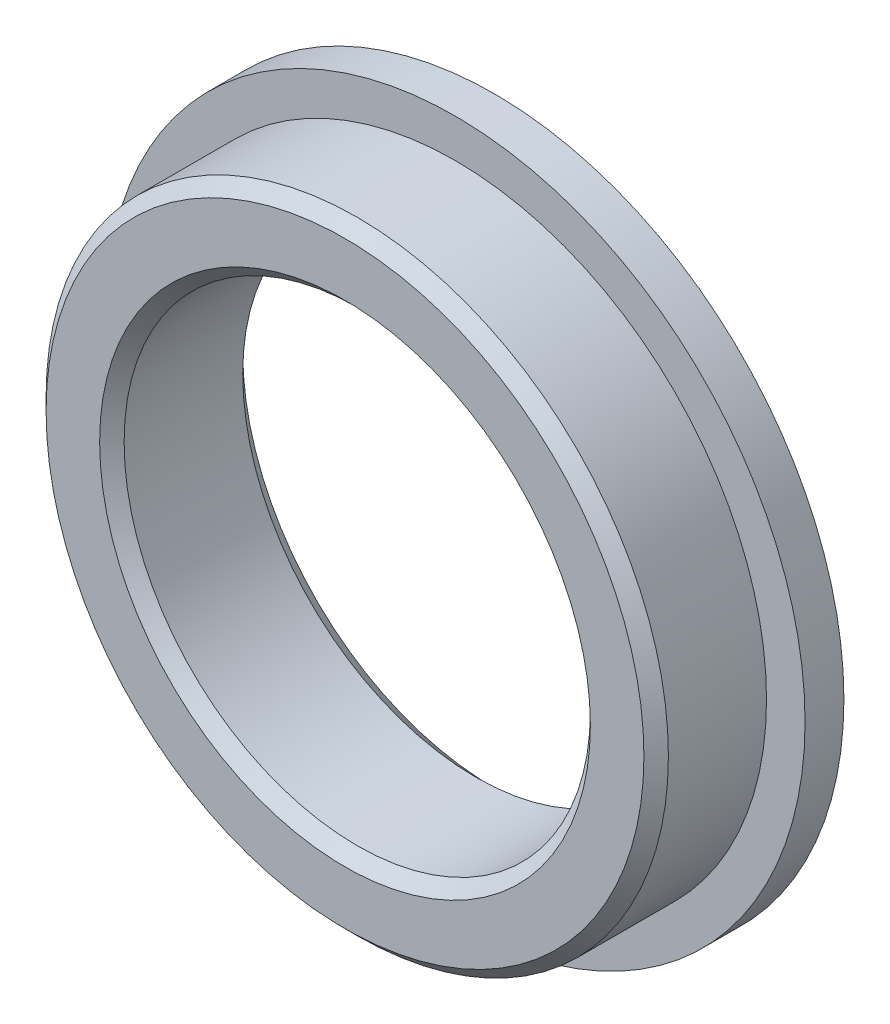
ISO-10303-21;
HEADER;
FILE_DESCRIPTION(('STEP AP214'),'2;1');
FILE_NAME('part.step','',(''),(''),'','','');
FILE_SCHEMA(('AUTOMOTIVE_DESIGN { 1 0 10303 214 1 1 1 1 }'));
ENDSEC;
DATA;
#1=APPLICATION_CONTEXT('core data for automotive mechanical design processes');
#2=APPLICATION_PROTOCOL_DEFINITION('international standard','automotive_design',2000,#1);
#3=PRODUCT_CONTEXT('',#1,'mechanical');
#4=PRODUCT('Part','Part','',(#3));
#5=PRODUCT_RELATED_PRODUCT_CATEGORY('part','',(#4));
#6=PRODUCT_DEFINITION_FORMATION('','',#4);
#7=PRODUCT_DEFINITION_CONTEXT('part definition',#1,'design');
#8=PRODUCT_DEFINITION('design','',#6,#7);
#9=PRODUCT_DEFINITION_SHAPE('','',#8);
#10=(LENGTH_UNIT() NAMED_UNIT(*) SI_UNIT(.MILLI.,.METRE.));
#11=(NAMED_UNIT(*) PLANE_ANGLE_UNIT() SI_UNIT($,.RADIAN.));
#12=(NAMED_UNIT(*) SI_UNIT($,.STERADIAN.) SOLID_ANGLE_UNIT());
#13=UNCERTAINTY_MEASURE_WITH_UNIT(LENGTH_MEASURE(1.E-05),#10,'distance_accuracy_value','');
#14=(GEOMETRIC_REPRESENTATION_CONTEXT(3) GLOBAL_UNCERTAINTY_ASSIGNED_CONTEXT((#13)) GLOBAL_UNIT_ASSIGNED_CONTEXT((#10,
#11,#12)) REPRESENTATION_CONTEXT('',''));
#15=CARTESIAN_POINT('',(0.,0.,0.));
#16=DIRECTION('',(0.,0.,1.));
#17=DIRECTION('',(1.,0.,0.));
#18=AXIS2_PLACEMENT_3D('',#15,#16,#17);
#19=CARTESIAN_POINT('',(0.,9.525,3.048));
#20=DIRECTION('',(0.,0.,-1.));
#21=DIRECTION('',(-1.,0.,0.));
#22=AXIS2_PLACEMENT_3D('',#19,#20,#21);
#23=PLANE('',#22);
#24=CARTESIAN_POINT('',(0.,0.,3.048));
#25=DIRECTION('',(0.,0.,-1.));
#26=DIRECTION('',(-1.,0.,0.));
#27=AXIS2_PLACEMENT_3D('',#24,#25,#26);
#28=CIRCLE('',#27,12.2127);
#29=CARTESIAN_POINT('',(-12.2127,0.,3.048));
#30=VERTEX_POINT('',#29);
#31=EDGE_CURVE('E19',#30,#30,#28,.T.);
#32=ORIENTED_EDGE('',*,*,#31,.F.);
#33=EDGE_LOOP('',(#32));
#34=FACE_BOUND('',#33,.T.);
#35=CARTESIAN_POINT('',(0.,0.,3.048));
#36=DIRECTION('',(0.,0.,1.));
#37=DIRECTION('',(1.,0.,0.));
#38=AXIS2_PLACEMENT_3D('',#35,#36,#37);
#39=CIRCLE('',#38,10.025);
#40=CARTESIAN_POINT('',(10.025,0.,3.048));
#41=VERTEX_POINT('',#40);
#42=EDGE_CURVE('E40',#41,#41,#39,.F.);
#43=ORIENTED_EDGE('',*,*,#42,.T.);
#44=EDGE_LOOP('',(#43));
#45=FACE_BOUND('',#44,.T.);
#46=ADVANCED_FACE('F16',(#34,#45),#23,.F.);
#47=CARTESIAN_POINT('',(0.,0.,2.548));
#48=DIRECTION('',(0.,0.,-1.));
#49=DIRECTION('',(-1.,0.,0.));
#50=AXIS2_PLACEMENT_3D('',#47,#48,#49);
#51=CONICAL_SURFACE('',#50,12.7127,0.785398163397447);
#52=CARTESIAN_POINT('',(0.,0.,2.548));
#53=DIRECTION('',(0.,0.,1.));
#54=DIRECTION('',(1.,0.,0.));
#55=AXIS2_PLACEMENT_3D('',#52,#53,#54);
#56=CIRCLE('',#55,12.7127);
#57=CARTESIAN_POINT('',(12.7127,0.,2.548));
#58=VERTEX_POINT('',#57);
#59=EDGE_CURVE('E31',#58,#58,#56,.F.);
#60=ORIENTED_EDGE('',*,*,#59,.F.);
#61=EDGE_LOOP('',(#60));
#62=FACE_BOUND('',#61,.T.);
#63=ORIENTED_EDGE('',*,*,#31,.T.);
#64=EDGE_LOOP('',(#63));
#65=FACE_BOUND('',#64,.T.);
#66=ADVANCED_FACE('F48',(#62,#65),#51,.T.);
#67=CARTESIAN_POINT('',(0.,0.,3.048));
#68=DIRECTION('',(0.,0.,1.));
#69=DIRECTION('',(1.,0.,0.));
#70=AXIS2_PLACEMENT_3D('',#67,#68,#69);
#71=CONICAL_SURFACE('',#70,10.025,0.785398163397446);
#72=ORIENTED_EDGE('',*,*,#42,.F.);
#73=EDGE_LOOP('',(#72));
#74=FACE_BOUND('',#73,.T.);
#75=CARTESIAN_POINT('',(0.,0.,2.54799999999999));
#76=DIRECTION('',(0.,0.,1.));
#77=DIRECTION('',(1.,0.,0.));
#78=AXIS2_PLACEMENT_3D('',#75,#76,#77);
#79=CIRCLE('',#78,9.525);
#80=CARTESIAN_POINT('',(9.525,0.,2.54799999999999));
#81=VERTEX_POINT('',#80);
#82=EDGE_CURVE('E39',#81,#81,#79,.F.);
#83=ORIENTED_EDGE('',*,*,#82,.T.);
#84=EDGE_LOOP('',(#83));
#85=FACE_BOUND('',#84,.T.);
#86=ADVANCED_FACE('F54',(#74,#85),#71,.F.);
#87=CARTESIAN_POINT('',(0.,0.,4.09575));
#88=DIRECTION('',(0.,0.,1.));
#89=DIRECTION('',(1.,0.,0.));
#90=AXIS2_PLACEMENT_3D('',#87,#88,#89);
#91=CYLINDRICAL_SURFACE('',#90,12.7127);
#92=ORIENTED_EDGE('',*,*,#59,.T.);
#93=EDGE_LOOP('',(#92));
#94=FACE_BOUND('',#93,.T.);
#95=CARTESIAN_POINT('',(0.,0.,-1.4605));
#96=DIRECTION('',(0.,0.,1.));
#97=DIRECTION('',(1.,0.,0.));
#98=AXIS2_PLACEMENT_3D('',#95,#96,#97);
#99=CIRCLE('',#98,12.7127);
#100=CARTESIAN_POINT('',(12.7127,0.,-1.4605));
#101=VERTEX_POINT('',#100);
#102=EDGE_CURVE('E37',#101,#101,#99,.T.);
#103=ORIENTED_EDGE('',*,*,#102,.T.);
#104=EDGE_LOOP('',(#103));
#105=FACE_BOUND('',#104,.T.);
#106=ADVANCED_FACE('F79',(#94,#105),#91,.T.);
#107=CARTESIAN_POINT('',(0.,0.,4.09575));
#108=DIRECTION('',(0.,0.,1.));
#109=DIRECTION('',(1.,0.,0.));
#110=AXIS2_PLACEMENT_3D('',#107,#108,#109);
#111=CYLINDRICAL_SURFACE('',#110,9.525);
#112=ORIENTED_EDGE('',*,*,#82,.F.);
#113=EDGE_LOOP('',(#112));
#114=FACE_BOUND('',#113,.T.);
#115=CARTESIAN_POINT('',(0.,0.,-2.298));
#116=DIRECTION('',(0.,0.,-1.));
#117=DIRECTION('',(-1.,0.,0.));
#118=AXIS2_PLACEMENT_3D('',#115,#116,#117);
#119=CIRCLE('',#118,9.525);
#120=CARTESIAN_POINT('',(-9.525,0.,-2.298));
#121=VERTEX_POINT('',#120);
#122=EDGE_CURVE('E36',#121,#121,#119,.T.);
#123=ORIENTED_EDGE('',*,*,#122,.T.);
#124=EDGE_LOOP('',(#123));
#125=FACE_BOUND('',#124,.T.);
#126=ADVANCED_FACE('F75',(#114,#125),#111,.F.);
#127=CARTESIAN_POINT('',(0.,12.7127,-1.4605));
#128=DIRECTION('',(0.,0.,-1.));
#129=DIRECTION('',(-1.,0.,0.));
#130=AXIS2_PLACEMENT_3D('',#127,#128,#129);
#131=PLANE('',#130);
#132=CARTESIAN_POINT('',(0.,0.,-1.4605));
#133=DIRECTION('',(0.,0.,1.));
#134=DIRECTION('',(1.,0.,0.));
#135=AXIS2_PLACEMENT_3D('',#132,#133,#134);
#136=CIRCLE('',#135,14.2875);
#137=CARTESIAN_POINT('',(14.2875,0.,-1.4605));
#138=VERTEX_POINT('',#137);
#139=EDGE_CURVE('E28',#138,#138,#136,.F.);
#140=ORIENTED_EDGE('',*,*,#139,.F.);
#141=EDGE_LOOP('',(#140));
#142=FACE_BOUND('',#141,.T.);
#143=ORIENTED_EDGE('',*,*,#102,.F.);
#144=EDGE_LOOP('',(#143));
#145=FACE_BOUND('',#144,.T.);
#146=ADVANCED_FACE('F71',(#142,#145),#131,.F.);
#147=CARTESIAN_POINT('',(0.,0.,-3.048));
#148=DIRECTION('',(0.,0.,-1.));
#149=DIRECTION('',(-1.,0.,0.));
#150=AXIS2_PLACEMENT_3D('',#147,#148,#149);
#151=CONICAL_SURFACE('',#150,10.275,0.785398163397446);
#152=CARTESIAN_POINT('',(0.,0.,-3.048));
#153=DIRECTION('',(0.,0.,-1.));
#154=DIRECTION('',(-1.,0.,0.));
#155=AXIS2_PLACEMENT_3D('',#152,#153,#154);
#156=CIRCLE('',#155,10.275);
#157=CARTESIAN_POINT('',(-10.275,0.,-3.048));
#158=VERTEX_POINT('',#157);
#159=EDGE_CURVE('E23',#158,#158,#156,.T.);
#160=ORIENTED_EDGE('',*,*,#159,.T.);
#161=EDGE_LOOP('',(#160));
#162=FACE_BOUND('',#161,.T.);
#163=ORIENTED_EDGE('',*,*,#122,.F.);
#164=EDGE_LOOP('',(#163));
#165=FACE_BOUND('',#164,.T.);
#166=ADVANCED_FACE('F64',(#162,#165),#151,.F.);
#167=CARTESIAN_POINT('',(0.,0.,4.09575));
#168=DIRECTION('',(0.,0.,1.));
#169=DIRECTION('',(1.,0.,0.));
#170=AXIS2_PLACEMENT_3D('',#167,#168,#169);
#171=CYLINDRICAL_SURFACE('',#170,14.2875);
#172=ORIENTED_EDGE('',*,*,#139,.T.);
#173=EDGE_LOOP('',(#172));
#174=FACE_BOUND('',#173,.T.);
#175=CARTESIAN_POINT('',(0.,0.,-3.048));
#176=DIRECTION('',(0.,0.,1.));
#177=DIRECTION('',(1.,0.,0.));
#178=AXIS2_PLACEMENT_3D('',#175,#176,#177);
#179=CIRCLE('',#178,14.2875);
#180=CARTESIAN_POINT('',(14.2875,0.,-3.048));
#181=VERTEX_POINT('',#180);
#182=EDGE_CURVE('E10',#181,#181,#179,.T.);
#183=ORIENTED_EDGE('',*,*,#182,.T.);
#184=EDGE_LOOP('',(#183));
#185=FACE_BOUND('',#184,.T.);
#186=ADVANCED_FACE('F58',(#174,#185),#171,.T.);
#187=CARTESIAN_POINT('',(0.,14.2875,-3.048));
#188=DIRECTION('',(0.,0.,1.));
#189=DIRECTION('',(1.,0.,0.));
#190=AXIS2_PLACEMENT_3D('',#187,#188,#189);
#191=PLANE('',#190);
#192=ORIENTED_EDGE('',*,*,#182,.F.);
#193=EDGE_LOOP('',(#192));
#194=FACE_BOUND('',#193,.T.);
#195=ORIENTED_EDGE('',*,*,#159,.F.);
#196=EDGE_LOOP('',(#195));
#197=FACE_BOUND('',#196,.T.);
#198=ADVANCED_FACE('F56',(#194,#197),#191,.F.);
#199=CLOSED_SHELL('',(#46,#66,#86,#106,#126,#146,#166,#186,#198));
#200=MANIFOLD_SOLID_BREP('B1',#199);
#201=ADVANCED_BREP_SHAPE_REPRESENTATION('',(#18,#200),#14);
#202=SHAPE_DEFINITION_REPRESENTATION(#9,#201);
ENDSEC;
END-ISO-10303-21;
